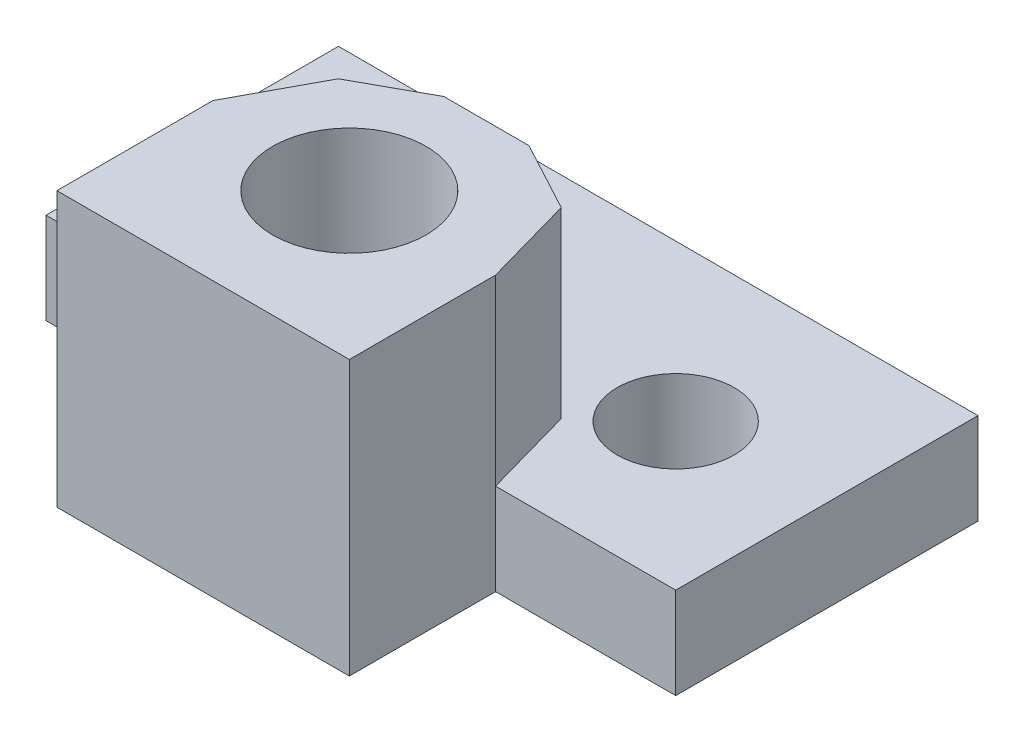
ISO-10303-21;
HEADER;
FILE_DESCRIPTION(('STEP AP214'),'2;1');
FILE_NAME('part.step','',(''),(''),'','','');
FILE_SCHEMA(('AUTOMOTIVE_DESIGN { 1 0 10303 214 1 1 1 1 }'));
ENDSEC;
DATA;
#1=APPLICATION_CONTEXT('core data for automotive mechanical design processes');
#2=APPLICATION_PROTOCOL_DEFINITION('international standard','automotive_design',2000,#1);
#3=PRODUCT_CONTEXT('',#1,'mechanical');
#4=PRODUCT('Part','Part','',(#3));
#5=PRODUCT_RELATED_PRODUCT_CATEGORY('part','',(#4));
#6=PRODUCT_DEFINITION_FORMATION('','',#4);
#7=PRODUCT_DEFINITION_CONTEXT('part definition',#1,'design');
#8=PRODUCT_DEFINITION('design','',#6,#7);
#9=PRODUCT_DEFINITION_SHAPE('','',#8);
#10=(LENGTH_UNIT() NAMED_UNIT(*) SI_UNIT(.MILLI.,.METRE.));
#11=(NAMED_UNIT(*) PLANE_ANGLE_UNIT() SI_UNIT($,.RADIAN.));
#12=(NAMED_UNIT(*) SI_UNIT($,.STERADIAN.) SOLID_ANGLE_UNIT());
#13=UNCERTAINTY_MEASURE_WITH_UNIT(LENGTH_MEASURE(1.E-05),#10,'distance_accuracy_value','');
#14=(GEOMETRIC_REPRESENTATION_CONTEXT(3) GLOBAL_UNCERTAINTY_ASSIGNED_CONTEXT((#13)) GLOBAL_UNIT_ASSIGNED_CONTEXT((#10,
#11,#12)) REPRESENTATION_CONTEXT('',''));
#15=CARTESIAN_POINT('',(0.,0.,0.));
#16=DIRECTION('',(0.,0.,1.));
#17=DIRECTION('',(1.,0.,0.));
#18=AXIS2_PLACEMENT_3D('',#15,#16,#17);
#19=CARTESIAN_POINT('',(0.,2.5,0.));
#20=DIRECTION('',(0.,1.,0.));
#21=DIRECTION('',(0.,0.,1.));
#22=AXIS2_PLACEMENT_3D('',#19,#20,#21);
#23=PLANE('',#22);
#24=DIRECTION('',(-0.473529911461162,0.,0.880777737543124));
#25=VECTOR('',#24,1.);
#26=CARTESIAN_POINT('',(-4.,2.5,5.6750936329588));
#27=LINE('',#26,#25);
#28=CARTESIAN_POINT('',(-2.80185217103239,2.5,3.44650804945475));
#29=VERTEX_POINT('',#28);
#30=CARTESIAN_POINT('',(-4.,2.5,5.6750936329588));
#31=VERTEX_POINT('',#30);
#32=EDGE_CURVE('E48',#29,#31,#27,.T.);
#33=ORIENTED_EDGE('',*,*,#32,.F.);
#34=DIRECTION('',(-0.876215908676647,0.,0.481918749772156));
#35=VECTOR('',#34,1.);
#36=CARTESIAN_POINT('',(-2.80185217103239,2.5,3.44650804945475));
#37=LINE('',#36,#35);
#38=CARTESIAN_POINT('',(-0.938175021400617,2.5,2.42148561715728));
#39=VERTEX_POINT('',#38);
#40=EDGE_CURVE('E52',#39,#29,#37,.T.);
#41=ORIENTED_EDGE('',*,*,#40,.F.);
#42=DIRECTION('',(-1.,0.,0.));
#43=VECTOR('',#42,1.);
#44=CARTESIAN_POINT('',(-0.938175021400617,2.5,2.42148561715728));
#45=LINE('',#44,#43);
#46=CARTESIAN_POINT('',(1.39142141563911,2.5,2.42148561715728));
#47=VERTEX_POINT('',#46);
#48=EDGE_CURVE('E255',#47,#39,#45,.T.);
#49=ORIENTED_EDGE('',*,*,#48,.F.);
#50=DIRECTION('',(-0.880777737543124,0.,-0.473529911461162));
#51=VECTOR('',#50,1.);
#52=CARTESIAN_POINT('',(1.39142141563911,2.5,2.42148561715728));
#53=LINE('',#52,#51);
#54=CARTESIAN_POINT('',(3.29798933669,2.5,3.44650804945475));
#55=VERTEX_POINT('',#54);
#56=EDGE_CURVE('E251',#55,#47,#53,.T.);
#57=ORIENTED_EDGE('',*,*,#56,.F.);
#58=DIRECTION('',(-0.270523545707351,0.,-0.962713358803088));
#59=VECTOR('',#58,1.);
#60=CARTESIAN_POINT('',(3.29798933669,2.5,3.44650804945475));
#61=LINE('',#60,#59);
#62=CARTESIAN_POINT('',(4.,2.5,5.94475655430712));
#63=VERTEX_POINT('',#62);
#64=EDGE_CURVE('E249',#63,#55,#61,.T.);
#65=ORIENTED_EDGE('',*,*,#64,.F.);
#66=DIRECTION('',(1.,0.,0.));
#67=VECTOR('',#66,1.);
#68=CARTESIAN_POINT('',(4.,2.5,5.94475655430712));
#69=LINE('',#68,#67);
#70=CARTESIAN_POINT('',(8.92811724877228,2.5,5.94475655430712));
#71=VERTEX_POINT('',#70);
#72=EDGE_CURVE('E186',#63,#71,#69,.T.);
#73=ORIENTED_EDGE('',*,*,#72,.T.);
#74=DIRECTION('',(0.,0.,-1.));
#75=VECTOR('',#74,1.);
#76=CARTESIAN_POINT('',(8.92811724877228,2.5,5.94475655430712));
#77=LINE('',#76,#75);
#78=CARTESIAN_POINT('',(8.92811724877228,2.5,-2.3249063670412));
#79=VERTEX_POINT('',#78);
#80=EDGE_CURVE('E188',#71,#79,#77,.T.);
#81=ORIENTED_EDGE('',*,*,#80,.T.);
#82=DIRECTION('',(-1.,0.,0.));
#83=VECTOR('',#82,1.);
#84=CARTESIAN_POINT('',(8.92811724877228,2.5,-2.3249063670412));
#85=LINE('',#84,#83);
#86=CARTESIAN_POINT('',(-8.56805471201539,2.5,-2.3249063670412));
#87=VERTEX_POINT('',#86);
#88=EDGE_CURVE('E178',#79,#87,#85,.T.);
#89=ORIENTED_EDGE('',*,*,#88,.T.);
#90=DIRECTION('',(0.,0.,1.));
#91=VECTOR('',#90,1.);
#92=CARTESIAN_POINT('',(-8.56805471201539,2.5,-2.3249063670412));
#93=LINE('',#92,#91);
#94=CARTESIAN_POINT('',(-8.56805471201539,2.5,5.6750936329588));
#95=VERTEX_POINT('',#94);
#96=EDGE_CURVE('E181',#87,#95,#93,.T.);
#97=ORIENTED_EDGE('',*,*,#96,.T.);
#98=DIRECTION('',(1.,0.,0.));
#99=VECTOR('',#98,1.);
#100=CARTESIAN_POINT('',(-8.56805471201539,2.5,5.6750936329588));
#101=LINE('',#100,#99);
#102=EDGE_CURVE('E184',#95,#31,#101,.T.);
#103=ORIENTED_EDGE('',*,*,#102,.T.);
#104=EDGE_LOOP('',(#33,#41,#49,#57,#65,#73,#81,#89,#97,#103));
#105=FACE_BOUND('',#104,.T.);
#106=CARTESIAN_POINT('',(4.92811724877228,2.5,1.94475655430712));
#107=DIRECTION('',(0.,1.,0.));
#108=DIRECTION('',(0.,0.,1.));
#109=AXIS2_PLACEMENT_3D('',#106,#107,#108);
#110=CIRCLE('',#109,1.6);
#111=CARTESIAN_POINT('',(4.92811724877228,2.5,3.54475655430712));
#112=VERTEX_POINT('',#111);
#113=EDGE_CURVE('E166',#112,#112,#110,.T.);
#114=ORIENTED_EDGE('',*,*,#113,.F.);
#115=EDGE_LOOP('',(#114));
#116=FACE_BOUND('',#115,.T.);
#117=CARTESIAN_POINT('',(-4.56805471201539,2.5,1.6750936329588));
#118=DIRECTION('',(0.,1.,0.));
#119=DIRECTION('',(0.,0.,1.));
#120=AXIS2_PLACEMENT_3D('',#117,#118,#119);
#121=CIRCLE('',#120,1.6);
#122=CARTESIAN_POINT('',(-4.56805471201539,2.5,3.2750936329588));
#123=VERTEX_POINT('',#122);
#124=EDGE_CURVE('E172',#123,#123,#121,.T.);
#125=ORIENTED_EDGE('',*,*,#124,.F.);
#126=EDGE_LOOP('',(#125));
#127=FACE_BOUND('',#126,.T.);
#128=ADVANCED_FACE('F33',(#105,#116,#127),#23,.T.);
#129=CARTESIAN_POINT('',(0.,0.,0.));
#130=DIRECTION('',(0.,1.,0.));
#131=DIRECTION('',(0.,0.,1.));
#132=AXIS2_PLACEMENT_3D('',#129,#130,#131);
#133=PLANE('',#132);
#134=DIRECTION('',(-1.,0.,0.));
#135=VECTOR('',#134,1.);
#136=CARTESIAN_POINT('',(8.92811724877228,0.,-2.3249063670412));
#137=LINE('',#136,#135);
#138=CARTESIAN_POINT('',(8.92811724877228,0.,-2.3249063670412));
#139=VERTEX_POINT('',#138);
#140=CARTESIAN_POINT('',(-8.56805471201539,0.,-2.3249063670412));
#141=VERTEX_POINT('',#140);
#142=EDGE_CURVE('E175',#139,#141,#137,.T.);
#143=ORIENTED_EDGE('',*,*,#142,.F.);
#144=DIRECTION('',(0.,0.,-1.));
#145=VECTOR('',#144,1.);
#146=CARTESIAN_POINT('',(8.92811724877228,0.,5.94475655430712));
#147=LINE('',#146,#145);
#148=CARTESIAN_POINT('',(8.92811724877228,0.,5.94475655430712));
#149=VERTEX_POINT('',#148);
#150=EDGE_CURVE('E182',#149,#139,#147,.T.);
#151=ORIENTED_EDGE('',*,*,#150,.F.);
#152=DIRECTION('',(1.,0.,0.));
#153=VECTOR('',#152,1.);
#154=CARTESIAN_POINT('',(4.,0.,5.94475655430712));
#155=LINE('',#154,#153);
#156=CARTESIAN_POINT('',(4.,0.,5.94475655430712));
#157=VERTEX_POINT('',#156);
#158=EDGE_CURVE('E203',#157,#149,#155,.T.);
#159=ORIENTED_EDGE('',*,*,#158,.F.);
#160=DIRECTION('',(0.,0.,-1.));
#161=VECTOR('',#160,1.);
#162=CARTESIAN_POINT('',(4.,0.,9.94475655430712));
#163=LINE('',#162,#161);
#164=CARTESIAN_POINT('',(4.,0.,9.94475655430712));
#165=VERTEX_POINT('',#164);
#166=EDGE_CURVE('E201',#165,#157,#163,.T.);
#167=ORIENTED_EDGE('',*,*,#166,.F.);
#168=DIRECTION('',(1.,0.,0.));
#169=VECTOR('',#168,1.);
#170=CARTESIAN_POINT('',(-4.,0.,9.94475655430712));
#171=LINE('',#170,#169);
#172=CARTESIAN_POINT('',(-4.,0.,9.94475655430712));
#173=VERTEX_POINT('',#172);
#174=EDGE_CURVE('E199',#173,#165,#171,.T.);
#175=ORIENTED_EDGE('',*,*,#174,.F.);
#176=DIRECTION('',(0.,0.,1.));
#177=VECTOR('',#176,1.);
#178=CARTESIAN_POINT('',(-4.,0.,5.6750936329588));
#179=LINE('',#178,#177);
#180=CARTESIAN_POINT('',(-4.,0.,5.6750936329588));
#181=VERTEX_POINT('',#180);
#182=EDGE_CURVE('E197',#181,#173,#179,.T.);
#183=ORIENTED_EDGE('',*,*,#182,.F.);
#184=DIRECTION('',(1.,0.,0.));
#185=VECTOR('',#184,1.);
#186=CARTESIAN_POINT('',(-8.56805471201539,0.,5.6750936329588));
#187=LINE('',#186,#185);
#188=CARTESIAN_POINT('',(-8.56805471201539,0.,5.6750936329588));
#189=VERTEX_POINT('',#188);
#190=EDGE_CURVE('E195',#189,#181,#187,.T.);
#191=ORIENTED_EDGE('',*,*,#190,.F.);
#192=DIRECTION('',(0.,0.,1.));
#193=VECTOR('',#192,1.);
#194=CARTESIAN_POINT('',(-8.56805471201539,0.,-2.3249063670412));
#195=LINE('',#194,#193);
#196=EDGE_CURVE('E193',#141,#189,#195,.T.);
#197=ORIENTED_EDGE('',*,*,#196,.F.);
#198=EDGE_LOOP('',(#143,#151,#159,#167,#175,#183,#191,#197));
#199=FACE_BOUND('',#198,.T.);
#200=CARTESIAN_POINT('',(-4.56805471201539,0.,1.6750936329588));
#201=DIRECTION('',(0.,1.,0.));
#202=DIRECTION('',(0.,0.,1.));
#203=AXIS2_PLACEMENT_3D('',#200,#201,#202);
#204=CIRCLE('',#203,1.6);
#205=CARTESIAN_POINT('',(-4.56805471201539,0.,3.2750936329588));
#206=VERTEX_POINT('',#205);
#207=EDGE_CURVE('E169',#206,#206,#204,.T.);
#208=ORIENTED_EDGE('',*,*,#207,.T.);
#209=EDGE_LOOP('',(#208));
#210=FACE_BOUND('',#209,.T.);
#211=CARTESIAN_POINT('',(4.92811724877228,0.,1.94475655430712));
#212=DIRECTION('',(0.,1.,0.));
#213=DIRECTION('',(0.,0.,1.));
#214=AXIS2_PLACEMENT_3D('',#211,#212,#213);
#215=CIRCLE('',#214,1.6);
#216=CARTESIAN_POINT('',(4.92811724877228,0.,3.54475655430712));
#217=VERTEX_POINT('',#216);
#218=EDGE_CURVE('E165',#217,#217,#215,.T.);
#219=ORIENTED_EDGE('',*,*,#218,.T.);
#220=EDGE_LOOP('',(#219));
#221=FACE_BOUND('',#220,.T.);
#222=CARTESIAN_POINT('',(0.,0.,5.94475655430712));
#223=DIRECTION('',(0.,1.,0.));
#224=DIRECTION('',(0.,0.,1.));
#225=AXIS2_PLACEMENT_3D('',#222,#223,#224);
#226=CIRCLE('',#225,2.5);
#227=CARTESIAN_POINT('',(0.,0.,8.44475655430712));
#228=VERTEX_POINT('',#227);
#229=EDGE_CURVE('E157',#228,#228,#226,.T.);
#230=ORIENTED_EDGE('',*,*,#229,.T.);
#231=EDGE_LOOP('',(#230));
#232=FACE_BOUND('',#231,.T.);
#233=ADVANCED_FACE('F230',(#199,#210,#221,#232),#133,.F.);
#234=CARTESIAN_POINT('',(8.92811724877228,2.5,-2.3249063670412));
#235=DIRECTION('',(0.,0.,1.));
#236=DIRECTION('',(1.,0.,0.));
#237=AXIS2_PLACEMENT_3D('',#234,#235,#236);
#238=PLANE('',#237);
#239=ORIENTED_EDGE('',*,*,#142,.T.);
#240=DIRECTION('',(0.,-1.,0.));
#241=VECTOR('',#240,1.);
#242=CARTESIAN_POINT('',(-8.56805471201539,2.5,-2.3249063670412));
#243=LINE('',#242,#241);
#244=EDGE_CURVE('E11',#87,#141,#243,.T.);
#245=ORIENTED_EDGE('',*,*,#244,.F.);
#246=ORIENTED_EDGE('',*,*,#88,.F.);
#247=DIRECTION('',(0.,-1.,0.));
#248=VECTOR('',#247,1.);
#249=CARTESIAN_POINT('',(8.92811724877228,2.5,-2.3249063670412));
#250=LINE('',#249,#248);
#251=EDGE_CURVE('E190',#79,#139,#250,.T.);
#252=ORIENTED_EDGE('',*,*,#251,.T.);
#253=EDGE_LOOP('',(#239,#245,#246,#252));
#254=FACE_BOUND('',#253,.T.);
#255=ADVANCED_FACE('F35',(#254),#238,.F.);
#256=CARTESIAN_POINT('',(-8.56805471201539,2.5,-2.3249063670412));
#257=DIRECTION('',(1.,0.,0.));
#258=DIRECTION('',(0.,0.,-1.));
#259=AXIS2_PLACEMENT_3D('',#256,#257,#258);
#260=PLANE('',#259);
#261=ORIENTED_EDGE('',*,*,#196,.T.);
#262=DIRECTION('',(0.,-1.,0.));
#263=VECTOR('',#262,1.);
#264=CARTESIAN_POINT('',(-8.56805471201539,2.5,5.6750936329588));
#265=LINE('',#264,#263);
#266=EDGE_CURVE('E41',#95,#189,#265,.T.);
#267=ORIENTED_EDGE('',*,*,#266,.F.);
#268=ORIENTED_EDGE('',*,*,#96,.F.);
#269=ORIENTED_EDGE('',*,*,#244,.T.);
#270=EDGE_LOOP('',(#261,#267,#268,#269));
#271=FACE_BOUND('',#270,.T.);
#272=ADVANCED_FACE('F285',(#271),#260,.F.);
#273=CARTESIAN_POINT('',(-8.56805471201539,2.5,5.6750936329588));
#274=DIRECTION('',(0.,0.,-1.));
#275=DIRECTION('',(-1.,0.,0.));
#276=AXIS2_PLACEMENT_3D('',#273,#274,#275);
#277=PLANE('',#276);
#278=ORIENTED_EDGE('',*,*,#190,.T.);
#279=DIRECTION('',(0.,-1.,0.));
#280=VECTOR('',#279,1.);
#281=CARTESIAN_POINT('',(-4.,2.5,5.6750936329588));
#282=LINE('',#281,#280);
#283=EDGE_CURVE('E217',#31,#181,#282,.T.);
#284=ORIENTED_EDGE('',*,*,#283,.F.);
#285=ORIENTED_EDGE('',*,*,#102,.F.);
#286=ORIENTED_EDGE('',*,*,#266,.T.);
#287=EDGE_LOOP('',(#278,#284,#285,#286));
#288=FACE_BOUND('',#287,.T.);
#289=ADVANCED_FACE('F224',(#288),#277,.F.);
#290=CARTESIAN_POINT('',(-4.,2.5,5.6750936329588));
#291=DIRECTION('',(1.,0.,0.));
#292=DIRECTION('',(0.,0.,-1.));
#293=AXIS2_PLACEMENT_3D('',#290,#291,#292);
#294=PLANE('',#293);
#295=ORIENTED_EDGE('',*,*,#182,.T.);
#296=DIRECTION('',(0.,-1.,0.));
#297=VECTOR('',#296,1.);
#298=CARTESIAN_POINT('',(-4.,2.5,9.94475655430712));
#299=LINE('',#298,#297);
#300=CARTESIAN_POINT('',(-4.,7.5,9.94475655430712));
#301=VERTEX_POINT('',#300);
#302=EDGE_CURVE('E214',#301,#173,#299,.T.);
#303=ORIENTED_EDGE('',*,*,#302,.F.);
#304=DIRECTION('',(0.,0.,1.));
#305=VECTOR('',#304,1.);
#306=CARTESIAN_POINT('',(-4.,7.5,9.94475655430712));
#307=LINE('',#306,#305);
#308=CARTESIAN_POINT('',(-4.,7.5,5.6750936329588));
#309=VERTEX_POINT('',#308);
#310=EDGE_CURVE('E241',#309,#301,#307,.T.);
#311=ORIENTED_EDGE('',*,*,#310,.F.);
#312=DIRECTION('',(0.,-1.,0.));
#313=VECTOR('',#312,1.);
#314=CARTESIAN_POINT('',(-4.,7.5,5.6750936329588));
#315=LINE('',#314,#313);
#316=EDGE_CURVE('E240',#309,#31,#315,.T.);
#317=ORIENTED_EDGE('',*,*,#316,.T.);
#318=ORIENTED_EDGE('',*,*,#283,.T.);
#319=EDGE_LOOP('',(#295,#303,#311,#317,#318));
#320=FACE_BOUND('',#319,.T.);
#321=ADVANCED_FACE('F235',(#320),#294,.F.);
#322=CARTESIAN_POINT('',(-4.,2.5,9.94475655430712));
#323=DIRECTION('',(0.,0.,-1.));
#324=DIRECTION('',(-1.,0.,0.));
#325=AXIS2_PLACEMENT_3D('',#322,#323,#324);
#326=PLANE('',#325);
#327=ORIENTED_EDGE('',*,*,#174,.T.);
#328=DIRECTION('',(0.,-1.,0.));
#329=VECTOR('',#328,1.);
#330=CARTESIAN_POINT('',(4.,2.5,9.94475655430712));
#331=LINE('',#330,#329);
#332=CARTESIAN_POINT('',(4.,7.5,9.94475655430712));
#333=VERTEX_POINT('',#332);
#334=EDGE_CURVE('E212',#333,#165,#331,.T.);
#335=ORIENTED_EDGE('',*,*,#334,.F.);
#336=DIRECTION('',(1.,0.,0.));
#337=VECTOR('',#336,1.);
#338=CARTESIAN_POINT('',(4.,7.5,9.94475655430712));
#339=LINE('',#338,#337);
#340=EDGE_CURVE('E145',#301,#333,#339,.T.);
#341=ORIENTED_EDGE('',*,*,#340,.F.);
#342=ORIENTED_EDGE('',*,*,#302,.T.);
#343=EDGE_LOOP('',(#327,#335,#341,#342));
#344=FACE_BOUND('',#343,.T.);
#345=ADVANCED_FACE('F239',(#344),#326,.F.);
#346=CARTESIAN_POINT('',(4.,2.5,9.94475655430712));
#347=DIRECTION('',(-1.,0.,0.));
#348=DIRECTION('',(0.,0.,1.));
#349=AXIS2_PLACEMENT_3D('',#346,#347,#348);
#350=PLANE('',#349);
#351=ORIENTED_EDGE('',*,*,#166,.T.);
#352=DIRECTION('',(0.,-1.,0.));
#353=VECTOR('',#352,1.);
#354=CARTESIAN_POINT('',(4.,2.5,5.94475655430712));
#355=LINE('',#354,#353);
#356=EDGE_CURVE('E152',#63,#157,#355,.T.);
#357=ORIENTED_EDGE('',*,*,#356,.F.);
#358=DIRECTION('',(0.,-1.,0.));
#359=VECTOR('',#358,1.);
#360=CARTESIAN_POINT('',(4.,7.5,5.94475655430712));
#361=LINE('',#360,#359);
#362=CARTESIAN_POINT('',(4.,7.5,5.94475655430712));
#363=VERTEX_POINT('',#362);
#364=EDGE_CURVE('E131',#363,#63,#361,.T.);
#365=ORIENTED_EDGE('',*,*,#364,.F.);
#366=DIRECTION('',(0.,0.,-1.));
#367=VECTOR('',#366,1.);
#368=CARTESIAN_POINT('',(4.,7.5,5.94475655430712));
#369=LINE('',#368,#367);
#370=EDGE_CURVE('E137',#333,#363,#369,.T.);
#371=ORIENTED_EDGE('',*,*,#370,.F.);
#372=ORIENTED_EDGE('',*,*,#334,.T.);
#373=EDGE_LOOP('',(#351,#357,#365,#371,#372));
#374=FACE_BOUND('',#373,.T.);
#375=ADVANCED_FACE('F150',(#374),#350,.F.);
#376=CARTESIAN_POINT('',(4.,2.5,5.94475655430712));
#377=DIRECTION('',(0.,0.,-1.));
#378=DIRECTION('',(-1.,0.,0.));
#379=AXIS2_PLACEMENT_3D('',#376,#377,#378);
#380=PLANE('',#379);
#381=ORIENTED_EDGE('',*,*,#158,.T.);
#382=DIRECTION('',(0.,-1.,0.));
#383=VECTOR('',#382,1.);
#384=CARTESIAN_POINT('',(8.92811724877228,2.5,5.94475655430712));
#385=LINE('',#384,#383);
#386=EDGE_CURVE('E208',#71,#149,#385,.T.);
#387=ORIENTED_EDGE('',*,*,#386,.F.);
#388=ORIENTED_EDGE('',*,*,#72,.F.);
#389=ORIENTED_EDGE('',*,*,#356,.T.);
#390=EDGE_LOOP('',(#381,#387,#388,#389));
#391=FACE_BOUND('',#390,.T.);
#392=ADVANCED_FACE('F277',(#391),#380,.F.);
#393=CARTESIAN_POINT('',(8.92811724877228,2.5,5.94475655430712));
#394=DIRECTION('',(-1.,0.,0.));
#395=DIRECTION('',(0.,0.,1.));
#396=AXIS2_PLACEMENT_3D('',#393,#394,#395);
#397=PLANE('',#396);
#398=ORIENTED_EDGE('',*,*,#150,.T.);
#399=ORIENTED_EDGE('',*,*,#251,.F.);
#400=ORIENTED_EDGE('',*,*,#80,.F.);
#401=ORIENTED_EDGE('',*,*,#386,.T.);
#402=EDGE_LOOP('',(#398,#399,#400,#401));
#403=FACE_BOUND('',#402,.T.);
#404=ADVANCED_FACE('F281',(#403),#397,.F.);
#405=CARTESIAN_POINT('',(-4.56805471201539,2.5,1.6750936329588));
#406=DIRECTION('',(0.,-1.,0.));
#407=DIRECTION('',(0.,0.,-1.));
#408=AXIS2_PLACEMENT_3D('',#405,#406,#407);
#409=CYLINDRICAL_SURFACE('',#408,1.6);
#410=ORIENTED_EDGE('',*,*,#124,.T.);
#411=EDGE_LOOP('',(#410));
#412=FACE_BOUND('',#411,.T.);
#413=ORIENTED_EDGE('',*,*,#207,.F.);
#414=EDGE_LOOP('',(#413));
#415=FACE_BOUND('',#414,.T.);
#416=ADVANCED_FACE('F299',(#412,#415),#409,.F.);
#417=CARTESIAN_POINT('',(4.92811724877228,2.5,1.94475655430712));
#418=DIRECTION('',(0.,-1.,0.));
#419=DIRECTION('',(0.,0.,-1.));
#420=AXIS2_PLACEMENT_3D('',#417,#418,#419);
#421=CYLINDRICAL_SURFACE('',#420,1.6);
#422=ORIENTED_EDGE('',*,*,#113,.T.);
#423=EDGE_LOOP('',(#422));
#424=FACE_BOUND('',#423,.T.);
#425=ORIENTED_EDGE('',*,*,#218,.F.);
#426=EDGE_LOOP('',(#425));
#427=FACE_BOUND('',#426,.T.);
#428=ADVANCED_FACE('F338',(#424,#427),#421,.F.);
#429=CARTESIAN_POINT('',(0.,2.5,5.94475655430712));
#430=DIRECTION('',(0.,-1.,0.));
#431=DIRECTION('',(0.,0.,-1.));
#432=AXIS2_PLACEMENT_3D('',#429,#430,#431);
#433=CYLINDRICAL_SURFACE('',#432,2.5);
#434=CARTESIAN_POINT('',(0.,2.5,5.94475655430712));
#435=DIRECTION('',(0.,1.,0.));
#436=DIRECTION('',(0.,0.,1.));
#437=AXIS2_PLACEMENT_3D('',#434,#435,#436);
#438=CIRCLE('',#437,2.5);
#439=CARTESIAN_POINT('',(0.,2.5,8.44475655430712));
#440=VERTEX_POINT('',#439);
#441=EDGE_CURVE('E154',#440,#440,#438,.T.);
#442=ORIENTED_EDGE('',*,*,#441,.T.);
#443=EDGE_LOOP('',(#442));
#444=FACE_BOUND('',#443,.T.);
#445=ORIENTED_EDGE('',*,*,#229,.F.);
#446=EDGE_LOOP('',(#445));
#447=FACE_BOUND('',#446,.T.);
#448=ADVANCED_FACE('F345',(#444,#447),#433,.F.);
#449=CARTESIAN_POINT('',(0.,2.5,0.));
#450=DIRECTION('',(0.,-1.,0.));
#451=DIRECTION('',(0.,0.,-1.));
#452=AXIS2_PLACEMENT_3D('',#449,#450,#451);
#453=PLANE('',#452);
#454=CARTESIAN_POINT('',(0.,2.5,5.94475655430712));
#455=DIRECTION('',(0.,1.,0.));
#456=DIRECTION('',(0.,0.,1.));
#457=AXIS2_PLACEMENT_3D('',#454,#455,#456);
#458=CIRCLE('',#457,2.1);
#459=CARTESIAN_POINT('',(0.,2.5,8.04475655430712));
#460=VERTEX_POINT('',#459);
#461=EDGE_CURVE('E480',#460,#460,#458,.T.);
#462=ORIENTED_EDGE('',*,*,#461,.T.);
#463=EDGE_LOOP('',(#462));
#464=FACE_BOUND('',#463,.T.);
#465=ORIENTED_EDGE('',*,*,#441,.F.);
#466=EDGE_LOOP('',(#465));
#467=FACE_BOUND('',#466,.T.);
#468=ADVANCED_FACE('F352',(#464,#467),#453,.T.);
#469=CARTESIAN_POINT('',(0.,7.5,0.));
#470=DIRECTION('',(0.,-1.,0.));
#471=DIRECTION('',(0.,0.,-1.));
#472=AXIS2_PLACEMENT_3D('',#469,#470,#471);
#473=PLANE('',#472);
#474=ORIENTED_EDGE('',*,*,#370,.T.);
#475=DIRECTION('',(-0.270523545707351,0.,-0.962713358803088));
#476=VECTOR('',#475,1.);
#477=CARTESIAN_POINT('',(3.29798933669,7.5,3.44650804945475));
#478=LINE('',#477,#476);
#479=CARTESIAN_POINT('',(3.29798933669,7.5,3.44650804945475));
#480=VERTEX_POINT('',#479);
#481=EDGE_CURVE('E126',#363,#480,#478,.T.);
#482=ORIENTED_EDGE('',*,*,#481,.T.);
#483=DIRECTION('',(-0.880777737543124,0.,-0.473529911461162));
#484=VECTOR('',#483,1.);
#485=CARTESIAN_POINT('',(1.39142141563911,7.5,2.42148561715728));
#486=LINE('',#485,#484);
#487=CARTESIAN_POINT('',(1.39142141563911,7.5,2.42148561715728));
#488=VERTEX_POINT('',#487);
#489=EDGE_CURVE('E136',#480,#488,#486,.T.);
#490=ORIENTED_EDGE('',*,*,#489,.T.);
#491=DIRECTION('',(-1.,0.,0.));
#492=VECTOR('',#491,1.);
#493=CARTESIAN_POINT('',(-0.938175021400617,7.5,2.42148561715728));
#494=LINE('',#493,#492);
#495=CARTESIAN_POINT('',(-0.938175021400617,7.5,2.42148561715728));
#496=VERTEX_POINT('',#495);
#497=EDGE_CURVE('E269',#488,#496,#494,.T.);
#498=ORIENTED_EDGE('',*,*,#497,.T.);
#499=DIRECTION('',(-0.876215908676647,0.,0.481918749772156));
#500=VECTOR('',#499,1.);
#501=CARTESIAN_POINT('',(-2.80185217103239,7.5,3.44650804945475));
#502=LINE('',#501,#500);
#503=CARTESIAN_POINT('',(-2.80185217103239,7.5,3.44650804945475));
#504=VERTEX_POINT('',#503);
#505=EDGE_CURVE('E486',#496,#504,#502,.T.);
#506=ORIENTED_EDGE('',*,*,#505,.T.);
#507=DIRECTION('',(-0.473529911461162,0.,0.880777737543124));
#508=VECTOR('',#507,1.);
#509=CARTESIAN_POINT('',(-4.,7.5,5.6750936329588));
#510=LINE('',#509,#508);
#511=EDGE_CURVE('E245',#504,#309,#510,.T.);
#512=ORIENTED_EDGE('',*,*,#511,.T.);
#513=ORIENTED_EDGE('',*,*,#310,.T.);
#514=ORIENTED_EDGE('',*,*,#340,.T.);
#515=EDGE_LOOP('',(#474,#482,#490,#498,#506,#512,#513,#514));
#516=FACE_BOUND('',#515,.T.);
#517=CARTESIAN_POINT('',(0.,7.5,5.94475655430712));
#518=DIRECTION('',(0.,1.,0.));
#519=DIRECTION('',(0.,0.,1.));
#520=AXIS2_PLACEMENT_3D('',#517,#518,#519);
#521=CIRCLE('',#520,2.1);
#522=CARTESIAN_POINT('',(0.,7.5,8.04475655430712));
#523=VERTEX_POINT('',#522);
#524=EDGE_CURVE('E252',#523,#523,#521,.T.);
#525=ORIENTED_EDGE('',*,*,#524,.F.);
#526=EDGE_LOOP('',(#525));
#527=FACE_BOUND('',#526,.T.);
#528=ADVANCED_FACE('F141',(#516,#527),#473,.F.);
#529=CARTESIAN_POINT('',(3.29798933669,7.5,3.44650804945475));
#530=DIRECTION('',(-0.962713358803088,0.,0.270523545707351));
#531=DIRECTION('',(0.270523545707351,0.,0.962713358803088));
#532=AXIS2_PLACEMENT_3D('',#529,#530,#531);
#533=PLANE('',#532);
#534=ORIENTED_EDGE('',*,*,#64,.T.);
#535=DIRECTION('',(0.,-1.,0.));
#536=VECTOR('',#535,1.);
#537=CARTESIAN_POINT('',(3.29798933669,7.5,3.44650804945475));
#538=LINE('',#537,#536);
#539=EDGE_CURVE('E133',#480,#55,#538,.T.);
#540=ORIENTED_EDGE('',*,*,#539,.F.);
#541=ORIENTED_EDGE('',*,*,#481,.F.);
#542=ORIENTED_EDGE('',*,*,#364,.T.);
#543=EDGE_LOOP('',(#534,#540,#541,#542));
#544=FACE_BOUND('',#543,.T.);
#545=ADVANCED_FACE('F129',(#544),#533,.F.);
#546=CARTESIAN_POINT('',(1.39142141563911,7.5,2.42148561715728));
#547=DIRECTION('',(-0.473529911461162,0.,0.880777737543124));
#548=DIRECTION('',(0.880777737543124,0.,0.473529911461162));
#549=AXIS2_PLACEMENT_3D('',#546,#547,#548);
#550=PLANE('',#549);
#551=ORIENTED_EDGE('',*,*,#56,.T.);
#552=DIRECTION('',(0.,-1.,0.));
#553=VECTOR('',#552,1.);
#554=CARTESIAN_POINT('',(1.39142141563911,7.5,2.42148561715728));
#555=LINE('',#554,#553);
#556=EDGE_CURVE('E159',#488,#47,#555,.T.);
#557=ORIENTED_EDGE('',*,*,#556,.F.);
#558=ORIENTED_EDGE('',*,*,#489,.F.);
#559=ORIENTED_EDGE('',*,*,#539,.T.);
#560=EDGE_LOOP('',(#551,#557,#558,#559));
#561=FACE_BOUND('',#560,.T.);
#562=ADVANCED_FACE('F271',(#561),#550,.F.);
#563=CARTESIAN_POINT('',(-0.938175021400617,7.5,2.42148561715728));
#564=DIRECTION('',(0.,0.,1.));
#565=DIRECTION('',(1.,0.,0.));
#566=AXIS2_PLACEMENT_3D('',#563,#564,#565);
#567=PLANE('',#566);
#568=ORIENTED_EDGE('',*,*,#48,.T.);
#569=DIRECTION('',(0.,-1.,0.));
#570=VECTOR('',#569,1.);
#571=CARTESIAN_POINT('',(-0.938175021400617,7.5,2.42148561715728));
#572=LINE('',#571,#570);
#573=EDGE_CURVE('E261',#496,#39,#572,.T.);
#574=ORIENTED_EDGE('',*,*,#573,.F.);
#575=ORIENTED_EDGE('',*,*,#497,.F.);
#576=ORIENTED_EDGE('',*,*,#556,.T.);
#577=EDGE_LOOP('',(#568,#574,#575,#576));
#578=FACE_BOUND('',#577,.T.);
#579=ADVANCED_FACE('F267',(#578),#567,.F.);
#580=CARTESIAN_POINT('',(-2.80185217103239,7.5,3.44650804945475));
#581=DIRECTION('',(0.481918749772156,0.,0.876215908676647));
#582=DIRECTION('',(0.876215908676647,0.,-0.481918749772156));
#583=AXIS2_PLACEMENT_3D('',#580,#581,#582);
#584=PLANE('',#583);
#585=ORIENTED_EDGE('',*,*,#40,.T.);
#586=DIRECTION('',(0.,-1.,0.));
#587=VECTOR('',#586,1.);
#588=CARTESIAN_POINT('',(-2.80185217103239,7.5,3.44650804945475));
#589=LINE('',#588,#587);
#590=EDGE_CURVE('E243',#504,#29,#589,.T.);
#591=ORIENTED_EDGE('',*,*,#590,.F.);
#592=ORIENTED_EDGE('',*,*,#505,.F.);
#593=ORIENTED_EDGE('',*,*,#573,.T.);
#594=EDGE_LOOP('',(#585,#591,#592,#593));
#595=FACE_BOUND('',#594,.T.);
#596=ADVANCED_FACE('F384',(#595),#584,.F.);
#597=CARTESIAN_POINT('',(-4.,7.5,5.6750936329588));
#598=DIRECTION('',(0.880777737543124,0.,0.473529911461162));
#599=DIRECTION('',(0.473529911461162,0.,-0.880777737543124));
#600=AXIS2_PLACEMENT_3D('',#597,#598,#599);
#601=PLANE('',#600);
#602=ORIENTED_EDGE('',*,*,#32,.T.);
#603=ORIENTED_EDGE('',*,*,#316,.F.);
#604=ORIENTED_EDGE('',*,*,#511,.F.);
#605=ORIENTED_EDGE('',*,*,#590,.T.);
#606=EDGE_LOOP('',(#602,#603,#604,#605));
#607=FACE_BOUND('',#606,.T.);
#608=ADVANCED_FACE('F391',(#607),#601,.F.);
#609=CARTESIAN_POINT('',(0.,7.5,5.94475655430712));
#610=DIRECTION('',(0.,-1.,0.));
#611=DIRECTION('',(0.,0.,-1.));
#612=AXIS2_PLACEMENT_3D('',#609,#610,#611);
#613=CYLINDRICAL_SURFACE('',#612,2.1);
#614=ORIENTED_EDGE('',*,*,#524,.T.);
#615=EDGE_LOOP('',(#614));
#616=FACE_BOUND('',#615,.T.);
#617=ORIENTED_EDGE('',*,*,#461,.F.);
#618=EDGE_LOOP('',(#617));
#619=FACE_BOUND('',#618,.T.);
#620=ADVANCED_FACE('F399',(#616,#619),#613,.F.);
#621=CLOSED_SHELL('',(#128,#233,#255,#272,#289,#321,#345,#375,#392,#404,#416,#428,#448,#468,
#528,#545,#562,#579,#596,#608,#620));
#622=MANIFOLD_SOLID_BREP('B2',#621);
#623=ADVANCED_BREP_SHAPE_REPRESENTATION('',(#18,#622),#14);
#624=SHAPE_DEFINITION_REPRESENTATION(#9,#623);
ENDSEC;
END-ISO-10303-21;
